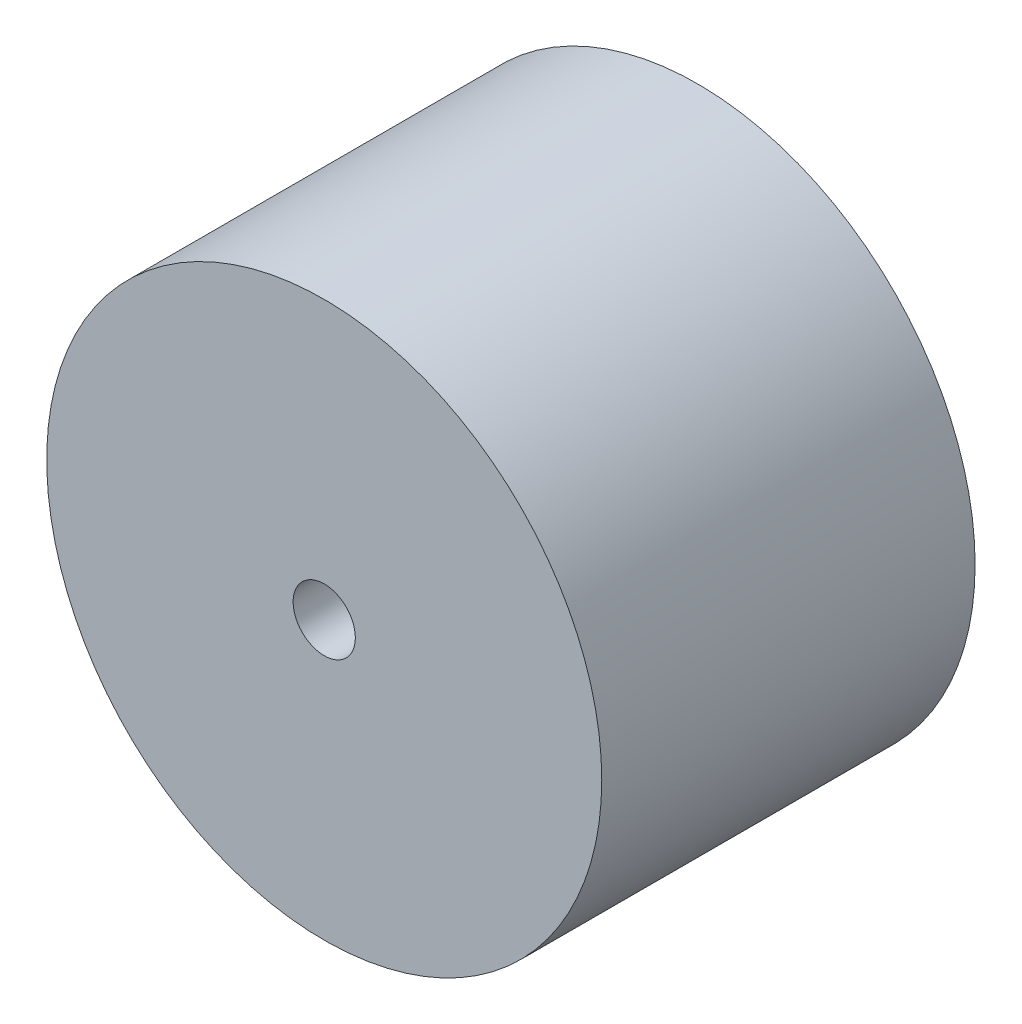
ISO-10303-21;
HEADER;
FILE_DESCRIPTION(('STEP AP214'),'2;1');
FILE_NAME('part.step','',(''),(''),'','','');
FILE_SCHEMA(('AUTOMOTIVE_DESIGN { 1 0 10303 214 1 1 1 1 }'));
ENDSEC;
DATA;
#1=APPLICATION_CONTEXT('core data for automotive mechanical design processes');
#2=APPLICATION_PROTOCOL_DEFINITION('international standard','automotive_design',2000,#1);
#3=PRODUCT_CONTEXT('',#1,'mechanical');
#4=PRODUCT('Part','Part','',(#3));
#5=PRODUCT_RELATED_PRODUCT_CATEGORY('part','',(#4));
#6=PRODUCT_DEFINITION_FORMATION('','',#4);
#7=PRODUCT_DEFINITION_CONTEXT('part definition',#1,'design');
#8=PRODUCT_DEFINITION('design','',#6,#7);
#9=PRODUCT_DEFINITION_SHAPE('','',#8);
#10=(LENGTH_UNIT() NAMED_UNIT(*) SI_UNIT(.MILLI.,.METRE.));
#11=(NAMED_UNIT(*) PLANE_ANGLE_UNIT() SI_UNIT($,.RADIAN.));
#12=(NAMED_UNIT(*) SI_UNIT($,.STERADIAN.) SOLID_ANGLE_UNIT());
#13=UNCERTAINTY_MEASURE_WITH_UNIT(LENGTH_MEASURE(1.E-05),#10,'distance_accuracy_value','');
#14=(GEOMETRIC_REPRESENTATION_CONTEXT(3) GLOBAL_UNCERTAINTY_ASSIGNED_CONTEXT((#13)) GLOBAL_UNIT_ASSIGNED_CONTEXT((#10,
#11,#12)) REPRESENTATION_CONTEXT('',''));
#15=CARTESIAN_POINT('',(0.,0.,0.));
#16=DIRECTION('',(0.,0.,1.));
#17=DIRECTION('',(1.,0.,0.));
#18=AXIS2_PLACEMENT_3D('',#15,#16,#17);
#19=CARTESIAN_POINT('',(0.,0.,38.1));
#20=DIRECTION('',(0.,0.,1.));
#21=DIRECTION('',(1.,0.,0.));
#22=AXIS2_PLACEMENT_3D('',#19,#20,#21);
#23=PLANE('',#22);
#24=CARTESIAN_POINT('',(0.,0.,38.1));
#25=DIRECTION('',(0.,0.,1.));
#26=DIRECTION('',(1.,0.,0.));
#27=AXIS2_PLACEMENT_3D('',#24,#25,#26);
#28=CIRCLE('',#27,28.321);
#29=CARTESIAN_POINT('',(28.321,0.,38.1));
#30=VERTEX_POINT('',#29);
#31=EDGE_CURVE('E10',#30,#30,#28,.T.);
#32=ORIENTED_EDGE('',*,*,#31,.T.);
#33=EDGE_LOOP('',(#32));
#34=FACE_BOUND('',#33,.T.);
#35=CARTESIAN_POINT('',(0.,0.,38.1));
#36=DIRECTION('',(0.,0.,1.));
#37=DIRECTION('',(1.,0.,0.));
#38=AXIS2_PLACEMENT_3D('',#35,#36,#37);
#39=CIRCLE('',#38,3.175);
#40=CARTESIAN_POINT('',(3.175,0.,38.1));
#41=VERTEX_POINT('',#40);
#42=EDGE_CURVE('E43',#41,#41,#39,.T.);
#43=ORIENTED_EDGE('',*,*,#42,.F.);
#44=EDGE_LOOP('',(#43));
#45=FACE_BOUND('',#44,.T.);
#46=ADVANCED_FACE('F32',(#34,#45),#23,.T.);
#47=CARTESIAN_POINT('',(0.,0.,0.));
#48=DIRECTION('',(0.,0.,1.));
#49=DIRECTION('',(1.,0.,0.));
#50=AXIS2_PLACEMENT_3D('',#47,#48,#49);
#51=PLANE('',#50);
#52=CARTESIAN_POINT('',(0.,0.,0.));
#53=DIRECTION('',(0.,0.,1.));
#54=DIRECTION('',(1.,0.,0.));
#55=AXIS2_PLACEMENT_3D('',#52,#53,#54);
#56=CIRCLE('',#55,28.321);
#57=CARTESIAN_POINT('',(28.321,0.,0.));
#58=VERTEX_POINT('',#57);
#59=EDGE_CURVE('E36',#58,#58,#56,.T.);
#60=ORIENTED_EDGE('',*,*,#59,.F.);
#61=EDGE_LOOP('',(#60));
#62=FACE_BOUND('',#61,.T.);
#63=CARTESIAN_POINT('',(0.,0.,0.));
#64=DIRECTION('',(0.,0.,1.));
#65=DIRECTION('',(1.,0.,0.));
#66=AXIS2_PLACEMENT_3D('',#63,#64,#65);
#67=CIRCLE('',#66,3.175);
#68=CARTESIAN_POINT('',(3.175,0.,0.));
#69=VERTEX_POINT('',#68);
#70=EDGE_CURVE('E45',#69,#69,#67,.T.);
#71=ORIENTED_EDGE('',*,*,#70,.T.);
#72=EDGE_LOOP('',(#71));
#73=FACE_BOUND('',#72,.T.);
#74=ADVANCED_FACE('F55',(#62,#73),#51,.F.);
#75=CARTESIAN_POINT('',(0.,0.,38.1));
#76=DIRECTION('',(0.,0.,-1.));
#77=DIRECTION('',(-1.,0.,0.));
#78=AXIS2_PLACEMENT_3D('',#75,#76,#77);
#79=CYLINDRICAL_SURFACE('',#78,28.321);
#80=ORIENTED_EDGE('',*,*,#31,.F.);
#81=EDGE_LOOP('',(#80));
#82=FACE_BOUND('',#81,.T.);
#83=ORIENTED_EDGE('',*,*,#59,.T.);
#84=EDGE_LOOP('',(#83));
#85=FACE_BOUND('',#84,.T.);
#86=ADVANCED_FACE('F34',(#82,#85),#79,.T.);
#87=CARTESIAN_POINT('',(0.,0.,38.1));
#88=DIRECTION('',(0.,0.,-1.));
#89=DIRECTION('',(-1.,0.,0.));
#90=AXIS2_PLACEMENT_3D('',#87,#88,#89);
#91=CYLINDRICAL_SURFACE('',#90,3.175);
#92=ORIENTED_EDGE('',*,*,#42,.T.);
#93=EDGE_LOOP('',(#92));
#94=FACE_BOUND('',#93,.T.);
#95=ORIENTED_EDGE('',*,*,#70,.F.);
#96=EDGE_LOOP('',(#95));
#97=FACE_BOUND('',#96,.T.);
#98=ADVANCED_FACE('F51',(#94,#97),#91,.F.);
#99=CLOSED_SHELL('',(#46,#74,#86,#98));
#100=MANIFOLD_SOLID_BREP('B2',#99);
#101=ADVANCED_BREP_SHAPE_REPRESENTATION('',(#18,#100),#14);
#102=SHAPE_DEFINITION_REPRESENTATION(#9,#101);
ENDSEC;
END-ISO-10303-21;
